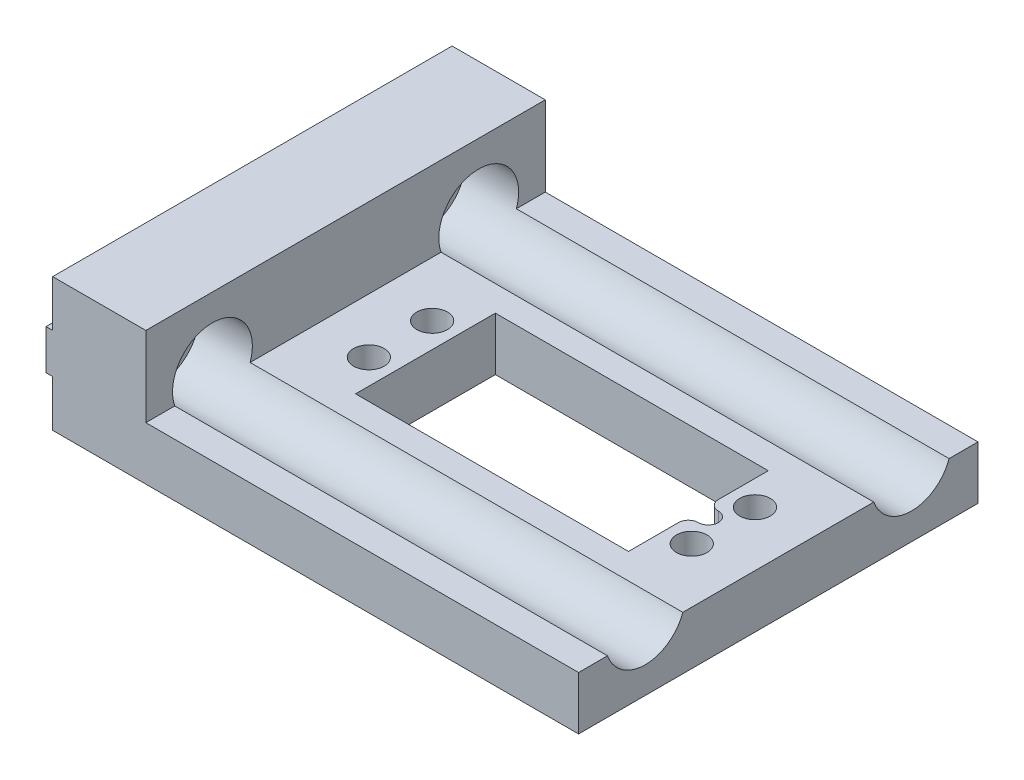
ISO-10303-21;
HEADER;
FILE_DESCRIPTION(('STEP AP214'),'2;1');
FILE_NAME('part.step','',(''),(''),'','','');
FILE_SCHEMA(('AUTOMOTIVE_DESIGN { 1 0 10303 214 1 1 1 1 }'));
ENDSEC;
DATA;
#1=APPLICATION_CONTEXT('core data for automotive mechanical design processes');
#2=APPLICATION_PROTOCOL_DEFINITION('international standard','automotive_design',2000,#1);
#3=PRODUCT_CONTEXT('',#1,'mechanical');
#4=PRODUCT('Part','Part','',(#3));
#5=PRODUCT_RELATED_PRODUCT_CATEGORY('part','',(#4));
#6=PRODUCT_DEFINITION_FORMATION('','',#4);
#7=PRODUCT_DEFINITION_CONTEXT('part definition',#1,'design');
#8=PRODUCT_DEFINITION('design','',#6,#7);
#9=PRODUCT_DEFINITION_SHAPE('','',#8);
#10=(LENGTH_UNIT() NAMED_UNIT(*) SI_UNIT(.MILLI.,.METRE.));
#11=(NAMED_UNIT(*) PLANE_ANGLE_UNIT() SI_UNIT($,.RADIAN.));
#12=(NAMED_UNIT(*) SI_UNIT($,.STERADIAN.) SOLID_ANGLE_UNIT());
#13=UNCERTAINTY_MEASURE_WITH_UNIT(LENGTH_MEASURE(1.E-05),#10,'distance_accuracy_value','');
#14=(GEOMETRIC_REPRESENTATION_CONTEXT(3) GLOBAL_UNCERTAINTY_ASSIGNED_CONTEXT((#13)) GLOBAL_UNIT_ASSIGNED_CONTEXT((#10,
#11,#12)) REPRESENTATION_CONTEXT('',''));
#15=CARTESIAN_POINT('',(0.,0.,0.));
#16=DIRECTION('',(0.,0.,1.));
#17=DIRECTION('',(1.,0.,0.));
#18=AXIS2_PLACEMENT_3D('',#15,#16,#17);
#19=CARTESIAN_POINT('',(67.,-20.,19.5));
#20=DIRECTION('',(1.,0.,0.));
#21=DIRECTION('',(0.,1.,0.));
#22=AXIS2_PLACEMENT_3D('',#19,#20,#21);
#23=PLANE('',#22);
#24=DIRECTION('',(0.,0.,-1.));
#25=VECTOR('',#24,1.);
#26=CARTESIAN_POINT('',(67.,-20.,19.5));
#27=LINE('',#26,#25);
#28=CARTESIAN_POINT('',(67.,-20.,27.));
#29=VERTEX_POINT('',#28);
#30=CARTESIAN_POINT('',(67.,-20.,19.5));
#31=VERTEX_POINT('',#30);
#32=EDGE_CURVE('E193',#29,#31,#27,.T.);
#33=ORIENTED_EDGE('',*,*,#32,.F.);
#34=DIRECTION('',(0.,1.,0.));
#35=VECTOR('',#34,1.);
#36=CARTESIAN_POINT('',(67.,-20.,27.));
#37=LINE('',#36,#35);
#38=CARTESIAN_POINT('',(67.,-12.,27.));
#39=VERTEX_POINT('',#38);
#40=EDGE_CURVE('E361',#29,#39,#37,.T.);
#41=ORIENTED_EDGE('',*,*,#40,.T.);
#42=DIRECTION('',(0.,0.,-1.));
#43=VECTOR('',#42,1.);
#44=CARTESIAN_POINT('',(67.,-12.,19.5));
#45=LINE('',#44,#43);
#46=CARTESIAN_POINT('',(67.,-12.,19.5));
#47=VERTEX_POINT('',#46);
#48=EDGE_CURVE('E211',#39,#47,#45,.T.);
#49=ORIENTED_EDGE('',*,*,#48,.T.);
#50=DIRECTION('',(0.,1.,0.));
#51=VECTOR('',#50,1.);
#52=CARTESIAN_POINT('',(67.,-20.,19.5));
#53=LINE('',#52,#51);
#54=EDGE_CURVE('E209',#31,#47,#53,.T.);
#55=ORIENTED_EDGE('',*,*,#54,.F.);
#56=EDGE_LOOP('',(#33,#41,#49,#55));
#57=FACE_BOUND('',#56,.T.);
#58=ADVANCED_FACE('F39',(#57),#23,.F.);
#59=CARTESIAN_POINT('',(79.,-12.,60.));
#60=DIRECTION('',(0.,-1.,0.));
#61=DIRECTION('',(1.,0.,0.));
#62=AXIS2_PLACEMENT_3D('',#59,#60,#61);
#63=PLANE('',#62);
#64=CARTESIAN_POINT('',(70.75,-12.,34.75));
#65=DIRECTION('',(0.,1.,0.));
#66=DIRECTION('',(-1.,0.,0.));
#67=AXIS2_PLACEMENT_3D('',#64,#65,#66);
#68=CIRCLE('',#67,2.29999999999999);
#69=CARTESIAN_POINT('',(68.45,-12.,34.75));
#70=VERTEX_POINT('',#69);
#71=EDGE_CURVE('E387',#70,#70,#68,.T.);
#72=ORIENTED_EDGE('',*,*,#71,.F.);
#73=EDGE_LOOP('',(#72));
#74=FACE_BOUND('',#73,.T.);
#75=CARTESIAN_POINT('',(70.75,-12.,25.25));
#76=DIRECTION('',(0.,1.,0.));
#77=DIRECTION('',(-1.,0.,0.));
#78=AXIS2_PLACEMENT_3D('',#75,#76,#77);
#79=CIRCLE('',#78,2.29999999999999);
#80=CARTESIAN_POINT('',(68.45,-12.,25.25));
#81=VERTEX_POINT('',#80);
#82=EDGE_CURVE('E409',#81,#81,#79,.T.);
#83=ORIENTED_EDGE('',*,*,#82,.F.);
#84=EDGE_LOOP('',(#83));
#85=FACE_BOUND('',#84,.T.);
#86=CARTESIAN_POINT('',(22.25,-12.,25.25));
#87=DIRECTION('',(0.,1.,0.));
#88=DIRECTION('',(-1.,0.,0.));
#89=AXIS2_PLACEMENT_3D('',#86,#87,#88);
#90=CIRCLE('',#89,2.3);
#91=CARTESIAN_POINT('',(19.95,-12.,25.25));
#92=VERTEX_POINT('',#91);
#93=EDGE_CURVE('E400',#92,#92,#90,.T.);
#94=ORIENTED_EDGE('',*,*,#93,.F.);
#95=EDGE_LOOP('',(#94));
#96=FACE_BOUND('',#95,.T.);
#97=CARTESIAN_POINT('',(22.25,-12.,34.75));
#98=DIRECTION('',(0.,1.,0.));
#99=DIRECTION('',(-1.,0.,0.));
#100=AXIS2_PLACEMENT_3D('',#97,#98,#99);
#101=CIRCLE('',#100,2.3);
#102=CARTESIAN_POINT('',(19.95,-12.,34.75));
#103=VERTEX_POINT('',#102);
#104=EDGE_CURVE('E398',#103,#103,#101,.T.);
#105=ORIENTED_EDGE('',*,*,#104,.F.);
#106=EDGE_LOOP('',(#105));
#107=FACE_BOUND('',#106,.T.);
#108=ORIENTED_EDGE('',*,*,#48,.F.);
#109=CARTESIAN_POINT('',(68.5,-12.,27.));
#110=DIRECTION('',(0.,-1.,0.));
#111=DIRECTION('',(1.,0.,0.));
#112=AXIS2_PLACEMENT_3D('',#109,#110,#111);
#113=CIRCLE('',#112,1.5);
#114=CARTESIAN_POINT('',(68.5,-12.,28.5));
#115=VERTEX_POINT('',#114);
#116=EDGE_CURVE('E365',#39,#115,#113,.F.);
#117=ORIENTED_EDGE('',*,*,#116,.T.);
#118=CARTESIAN_POINT('',(68.5,-12.,30.));
#119=DIRECTION('',(0.,-1.,0.));
#120=DIRECTION('',(1.,0.,0.));
#121=AXIS2_PLACEMENT_3D('',#118,#119,#120);
#122=CIRCLE('',#121,1.5);
#123=CARTESIAN_POINT('',(70.,-12.,30.));
#124=VERTEX_POINT('',#123);
#125=EDGE_CURVE('E48',#115,#124,#122,.T.);
#126=ORIENTED_EDGE('',*,*,#125,.T.);
#127=CARTESIAN_POINT('',(68.5,-12.,30.));
#128=DIRECTION('',(0.,-1.,0.));
#129=DIRECTION('',(1.,0.,0.));
#130=AXIS2_PLACEMENT_3D('',#127,#128,#129);
#131=CIRCLE('',#130,1.5);
#132=CARTESIAN_POINT('',(68.5,-12.,31.5));
#133=VERTEX_POINT('',#132);
#134=EDGE_CURVE('E372',#124,#133,#131,.T.);
#135=ORIENTED_EDGE('',*,*,#134,.T.);
#136=CARTESIAN_POINT('',(68.5,-12.,33.));
#137=DIRECTION('',(0.,-1.,0.));
#138=DIRECTION('',(1.,0.,0.));
#139=AXIS2_PLACEMENT_3D('',#136,#137,#138);
#140=CIRCLE('',#139,1.5);
#141=CARTESIAN_POINT('',(67.,-12.,33.));
#142=VERTEX_POINT('',#141);
#143=EDGE_CURVE('E363',#133,#142,#140,.F.);
#144=ORIENTED_EDGE('',*,*,#143,.T.);
#145=CARTESIAN_POINT('',(67.,-12.,40.5));
#146=VERTEX_POINT('',#145);
#147=EDGE_CURVE('E228',#146,#142,#45,.T.);
#148=ORIENTED_EDGE('',*,*,#147,.F.);
#149=DIRECTION('',(1.,0.,0.));
#150=VECTOR('',#149,1.);
#151=CARTESIAN_POINT('',(26.,-12.,40.5));
#152=LINE('',#151,#150);
#153=CARTESIAN_POINT('',(26.,-12.,40.5));
#154=VERTEX_POINT('',#153);
#155=EDGE_CURVE('E206',#154,#146,#152,.T.);
#156=ORIENTED_EDGE('',*,*,#155,.F.);
#157=DIRECTION('',(0.,0.,1.));
#158=VECTOR('',#157,1.);
#159=CARTESIAN_POINT('',(26.,-12.,19.5));
#160=LINE('',#159,#158);
#161=CARTESIAN_POINT('',(26.,-12.,19.5));
#162=VERTEX_POINT('',#161);
#163=EDGE_CURVE('E233',#162,#154,#160,.T.);
#164=ORIENTED_EDGE('',*,*,#163,.F.);
#165=DIRECTION('',(-1.,0.,0.));
#166=VECTOR('',#165,1.);
#167=CARTESIAN_POINT('',(26.,-12.,19.5));
#168=LINE('',#167,#166);
#169=EDGE_CURVE('E231',#47,#162,#168,.T.);
#170=ORIENTED_EDGE('',*,*,#169,.F.);
#171=EDGE_LOOP('',(#108,#117,#126,#135,#144,#148,#156,#164,#170));
#172=FACE_BOUND('',#171,.T.);
#173=DIRECTION('',(0.,0.,-1.));
#174=VECTOR('',#173,1.);
#175=CARTESIAN_POINT('',(14.,-12.,60.));
#176=LINE('',#175,#174);
#177=CARTESIAN_POINT('',(14.,-12.,44.3431457505076));
#178=VERTEX_POINT('',#177);
#179=CARTESIAN_POINT('',(14.,-12.,15.6568542494924));
#180=VERTEX_POINT('',#179);
#181=EDGE_CURVE('E325',#178,#180,#176,.T.);
#182=ORIENTED_EDGE('',*,*,#181,.F.);
#183=DIRECTION('',(1.,0.,0.));
#184=VECTOR('',#183,1.);
#185=CARTESIAN_POINT('',(6.00000000000001,-12.,44.3431457505076));
#186=LINE('',#185,#184);
#187=CARTESIAN_POINT('',(79.,-12.,44.3431457505076));
#188=VERTEX_POINT('',#187);
#189=EDGE_CURVE('E264',#178,#188,#186,.T.);
#190=ORIENTED_EDGE('',*,*,#189,.T.);
#191=DIRECTION('',(0.,0.,-1.));
#192=VECTOR('',#191,1.);
#193=CARTESIAN_POINT('',(79.,-12.,60.));
#194=LINE('',#193,#192);
#195=CARTESIAN_POINT('',(79.,-12.,15.6568542494924));
#196=VERTEX_POINT('',#195);
#197=EDGE_CURVE('E330',#188,#196,#194,.T.);
#198=ORIENTED_EDGE('',*,*,#197,.T.);
#199=DIRECTION('',(1.,0.,0.));
#200=VECTOR('',#199,1.);
#201=CARTESIAN_POINT('',(6.00000000000001,-12.,15.6568542494924));
#202=LINE('',#201,#200);
#203=EDGE_CURVE('E254',#196,#180,#202,.F.);
#204=ORIENTED_EDGE('',*,*,#203,.T.);
#205=EDGE_LOOP('',(#182,#190,#198,#204));
#206=FACE_BOUND('',#205,.T.);
#207=ADVANCED_FACE('F426',(#74,#85,#96,#107,#172,#206),#63,.F.);
#208=CARTESIAN_POINT('',(14.,-12.,4.34314575050762));
#209=VERTEX_POINT('',#208);
#210=CARTESIAN_POINT('',(14.,-12.,0.));
#211=VERTEX_POINT('',#210);
#212=EDGE_CURVE('E320',#209,#211,#176,.T.);
#213=ORIENTED_EDGE('',*,*,#212,.F.);
#214=DIRECTION('',(1.,0.,0.));
#215=VECTOR('',#214,1.);
#216=CARTESIAN_POINT('',(6.00000000000001,-12.,4.34314575050762));
#217=LINE('',#216,#215);
#218=CARTESIAN_POINT('',(79.,-12.,4.34314575050762));
#219=VERTEX_POINT('',#218);
#220=EDGE_CURVE('E257',#209,#219,#217,.T.);
#221=ORIENTED_EDGE('',*,*,#220,.T.);
#222=CARTESIAN_POINT('',(79.,-12.,0.));
#223=VERTEX_POINT('',#222);
#224=EDGE_CURVE('E324',#219,#223,#194,.T.);
#225=ORIENTED_EDGE('',*,*,#224,.T.);
#226=DIRECTION('',(-1.,0.,0.));
#227=VECTOR('',#226,1.);
#228=CARTESIAN_POINT('',(79.,-12.,0.));
#229=LINE('',#228,#227);
#230=EDGE_CURVE('E314',#223,#211,#229,.T.);
#231=ORIENTED_EDGE('',*,*,#230,.T.);
#232=EDGE_LOOP('',(#213,#221,#225,#231));
#233=FACE_BOUND('',#232,.T.);
#234=ADVANCED_FACE('F429',(#233),#63,.F.);
#235=CARTESIAN_POINT('',(-0.999999999999999,-10.,10.));
#236=DIRECTION('',(1.,0.,0.));
#237=DIRECTION('',(0.,0.,-1.));
#238=AXIS2_PLACEMENT_3D('',#235,#236,#237);
#239=CYLINDRICAL_SURFACE('',#238,2.75);
#240=CARTESIAN_POINT('',(-0.999999999999999,-10.,10.));
#241=DIRECTION('',(1.,0.,0.));
#242=DIRECTION('',(0.,0.,-1.));
#243=AXIS2_PLACEMENT_3D('',#240,#241,#242);
#244=CIRCLE('',#243,2.75);
#245=CARTESIAN_POINT('',(-0.999999999999999,-10.,7.25));
#246=VERTEX_POINT('',#245);
#247=EDGE_CURVE('E267',#246,#246,#244,.T.);
#248=ORIENTED_EDGE('',*,*,#247,.F.);
#249=EDGE_LOOP('',(#248));
#250=FACE_BOUND('',#249,.T.);
#251=CARTESIAN_POINT('',(6.00000000000001,-10.,10.));
#252=DIRECTION('',(1.,0.,0.));
#253=DIRECTION('',(0.,0.,-1.));
#254=AXIS2_PLACEMENT_3D('',#251,#252,#253);
#255=CIRCLE('',#254,2.75);
#256=CARTESIAN_POINT('',(6.00000000000001,-10.,7.25));
#257=VERTEX_POINT('',#256);
#258=EDGE_CURVE('E258',#257,#257,#255,.F.);
#259=ORIENTED_EDGE('',*,*,#258,.F.);
#260=EDGE_LOOP('',(#259));
#261=FACE_BOUND('',#260,.T.);
#262=ADVANCED_FACE('F677',(#250,#261),#239,.F.);
#263=CARTESIAN_POINT('',(-0.999999999999999,-10.,50.));
#264=DIRECTION('',(1.,0.,0.));
#265=DIRECTION('',(0.,0.,-1.));
#266=AXIS2_PLACEMENT_3D('',#263,#264,#265);
#267=CYLINDRICAL_SURFACE('',#266,2.75);
#268=CARTESIAN_POINT('',(-0.999999999999999,-10.,50.));
#269=DIRECTION('',(1.,0.,0.));
#270=DIRECTION('',(0.,0.,-1.));
#271=AXIS2_PLACEMENT_3D('',#268,#269,#270);
#272=CIRCLE('',#271,2.75);
#273=CARTESIAN_POINT('',(-0.999999999999999,-10.,47.25));
#274=VERTEX_POINT('',#273);
#275=EDGE_CURVE('E268',#274,#274,#272,.T.);
#276=ORIENTED_EDGE('',*,*,#275,.F.);
#277=EDGE_LOOP('',(#276));
#278=FACE_BOUND('',#277,.T.);
#279=CARTESIAN_POINT('',(6.00000000000001,-10.,50.));
#280=DIRECTION('',(1.,0.,0.));
#281=DIRECTION('',(0.,0.,-1.));
#282=AXIS2_PLACEMENT_3D('',#279,#280,#281);
#283=CIRCLE('',#282,2.75);
#284=CARTESIAN_POINT('',(6.00000000000001,-10.,47.25));
#285=VERTEX_POINT('',#284);
#286=EDGE_CURVE('E247',#285,#285,#283,.F.);
#287=ORIENTED_EDGE('',*,*,#286,.F.);
#288=EDGE_LOOP('',(#287));
#289=FACE_BOUND('',#288,.T.);
#290=ADVANCED_FACE('F562',(#278,#289),#267,.F.);
#291=CARTESIAN_POINT('',(14.,0.,60.));
#292=DIRECTION('',(0.,-1.,0.));
#293=DIRECTION('',(1.,0.,0.));
#294=AXIS2_PLACEMENT_3D('',#291,#292,#293);
#295=PLANE('',#294);
#296=DIRECTION('',(-1.,0.,0.));
#297=VECTOR('',#296,1.);
#298=CARTESIAN_POINT('',(14.,0.,0.));
#299=LINE('',#298,#297);
#300=CARTESIAN_POINT('',(14.,0.,0.));
#301=VERTEX_POINT('',#300);
#302=CARTESIAN_POINT('',(0.,0.,0.));
#303=VERTEX_POINT('',#302);
#304=EDGE_CURVE('E271',#301,#303,#299,.T.);
#305=ORIENTED_EDGE('',*,*,#304,.T.);
#306=DIRECTION('',(0.,0.,-1.));
#307=VECTOR('',#306,1.);
#308=CARTESIAN_POINT('',(0.,0.,60.));
#309=LINE('',#308,#307);
#310=CARTESIAN_POINT('',(0.,0.,60.));
#311=VERTEX_POINT('',#310);
#312=EDGE_CURVE('E348',#311,#303,#309,.T.);
#313=ORIENTED_EDGE('',*,*,#312,.F.);
#314=DIRECTION('',(-1.,0.,0.));
#315=VECTOR('',#314,1.);
#316=CARTESIAN_POINT('',(14.,0.,60.));
#317=LINE('',#316,#315);
#318=CARTESIAN_POINT('',(14.,0.,60.));
#319=VERTEX_POINT('',#318);
#320=EDGE_CURVE('E274',#319,#311,#317,.T.);
#321=ORIENTED_EDGE('',*,*,#320,.F.);
#322=DIRECTION('',(0.,0.,-1.));
#323=VECTOR('',#322,1.);
#324=CARTESIAN_POINT('',(14.,0.,60.));
#325=LINE('',#324,#323);
#326=EDGE_CURVE('E296',#319,#301,#325,.T.);
#327=ORIENTED_EDGE('',*,*,#326,.T.);
#328=EDGE_LOOP('',(#305,#313,#321,#327));
#329=FACE_BOUND('',#328,.T.);
#330=ADVANCED_FACE('F454',(#329),#295,.F.);
#331=CARTESIAN_POINT('',(0.,0.,60.));
#332=DIRECTION('',(1.,0.,0.));
#333=DIRECTION('',(0.,0.,-1.));
#334=AXIS2_PLACEMENT_3D('',#331,#332,#333);
#335=PLANE('',#334);
#336=DIRECTION('',(0.,-1.,0.));
#337=VECTOR('',#336,1.);
#338=CARTESIAN_POINT('',(0.,0.,0.));
#339=LINE('',#338,#337);
#340=CARTESIAN_POINT('',(0.,-7.,0.));
#341=VERTEX_POINT('',#340);
#342=EDGE_CURVE('E299',#303,#341,#339,.T.);
#343=ORIENTED_EDGE('',*,*,#342,.T.);
#344=DIRECTION('',(0.,0.,-1.));
#345=VECTOR('',#344,1.);
#346=CARTESIAN_POINT('',(0.,-7.,60.));
#347=LINE('',#346,#345);
#348=CARTESIAN_POINT('',(0.,-7.,60.));
#349=VERTEX_POINT('',#348);
#350=EDGE_CURVE('E345',#349,#341,#347,.T.);
#351=ORIENTED_EDGE('',*,*,#350,.F.);
#352=DIRECTION('',(0.,-1.,0.));
#353=VECTOR('',#352,1.);
#354=CARTESIAN_POINT('',(0.,0.,60.));
#355=LINE('',#354,#353);
#356=EDGE_CURVE('E277',#311,#349,#355,.T.);
#357=ORIENTED_EDGE('',*,*,#356,.F.);
#358=ORIENTED_EDGE('',*,*,#312,.T.);
#359=EDGE_LOOP('',(#343,#351,#357,#358));
#360=FACE_BOUND('',#359,.T.);
#361=ADVANCED_FACE('F555',(#360),#335,.F.);
#362=CARTESIAN_POINT('',(0.,-7.,60.));
#363=DIRECTION('',(0.,-1.,0.));
#364=DIRECTION('',(1.,0.,0.));
#365=AXIS2_PLACEMENT_3D('',#362,#363,#364);
#366=PLANE('',#365);
#367=DIRECTION('',(-1.,0.,0.));
#368=VECTOR('',#367,1.);
#369=CARTESIAN_POINT('',(0.,-7.,0.));
#370=LINE('',#369,#368);
#371=CARTESIAN_POINT('',(-1.,-7.,0.));
#372=VERTEX_POINT('',#371);
#373=EDGE_CURVE('E301',#341,#372,#370,.T.);
#374=ORIENTED_EDGE('',*,*,#373,.T.);
#375=DIRECTION('',(0.,0.,-1.));
#376=VECTOR('',#375,1.);
#377=CARTESIAN_POINT('',(-1.,-7.,60.));
#378=LINE('',#377,#376);
#379=CARTESIAN_POINT('',(-1.,-7.,60.));
#380=VERTEX_POINT('',#379);
#381=EDGE_CURVE('E342',#380,#372,#378,.T.);
#382=ORIENTED_EDGE('',*,*,#381,.F.);
#383=DIRECTION('',(-1.,0.,0.));
#384=VECTOR('',#383,1.);
#385=CARTESIAN_POINT('',(0.,-7.,60.));
#386=LINE('',#385,#384);
#387=EDGE_CURVE('E280',#349,#380,#386,.T.);
#388=ORIENTED_EDGE('',*,*,#387,.F.);
#389=ORIENTED_EDGE('',*,*,#350,.T.);
#390=EDGE_LOOP('',(#374,#382,#388,#389));
#391=FACE_BOUND('',#390,.T.);
#392=ADVANCED_FACE('F551',(#391),#366,.F.);
#393=CARTESIAN_POINT('',(-1.,-7.,60.));
#394=DIRECTION('',(1.,0.,0.));
#395=DIRECTION('',(0.,0.,-1.));
#396=AXIS2_PLACEMENT_3D('',#393,#394,#395);
#397=PLANE('',#396);
#398=ORIENTED_EDGE('',*,*,#275,.T.);
#399=EDGE_LOOP('',(#398));
#400=FACE_BOUND('',#399,.T.);
#401=ORIENTED_EDGE('',*,*,#247,.T.);
#402=EDGE_LOOP('',(#401));
#403=FACE_BOUND('',#402,.T.);
#404=DIRECTION('',(0.,-1.,0.));
#405=VECTOR('',#404,1.);
#406=CARTESIAN_POINT('',(-1.,-7.,0.));
#407=LINE('',#406,#405);
#408=CARTESIAN_POINT('',(-1.,-13.,0.));
#409=VERTEX_POINT('',#408);
#410=EDGE_CURVE('E303',#372,#409,#407,.T.);
#411=ORIENTED_EDGE('',*,*,#410,.T.);
#412=DIRECTION('',(0.,0.,-1.));
#413=VECTOR('',#412,1.);
#414=CARTESIAN_POINT('',(-1.,-13.,60.));
#415=LINE('',#414,#413);
#416=CARTESIAN_POINT('',(-1.,-13.,60.));
#417=VERTEX_POINT('',#416);
#418=EDGE_CURVE('E339',#417,#409,#415,.T.);
#419=ORIENTED_EDGE('',*,*,#418,.F.);
#420=DIRECTION('',(0.,-1.,0.));
#421=VECTOR('',#420,1.);
#422=CARTESIAN_POINT('',(-1.,-7.,60.));
#423=LINE('',#422,#421);
#424=EDGE_CURVE('E282',#380,#417,#423,.T.);
#425=ORIENTED_EDGE('',*,*,#424,.F.);
#426=ORIENTED_EDGE('',*,*,#381,.T.);
#427=EDGE_LOOP('',(#411,#419,#425,#426));
#428=FACE_BOUND('',#427,.T.);
#429=ADVANCED_FACE('F547',(#400,#403,#428),#397,.F.);
#430=CARTESIAN_POINT('',(-1.,-13.,60.));
#431=DIRECTION('',(0.,1.,0.));
#432=DIRECTION('',(-1.,0.,0.));
#433=AXIS2_PLACEMENT_3D('',#430,#431,#432);
#434=PLANE('',#433);
#435=DIRECTION('',(1.,0.,0.));
#436=VECTOR('',#435,1.);
#437=CARTESIAN_POINT('',(-1.,-13.,0.));
#438=LINE('',#437,#436);
#439=CARTESIAN_POINT('',(0.,-13.,0.));
#440=VERTEX_POINT('',#439);
#441=EDGE_CURVE('E305',#409,#440,#438,.T.);
#442=ORIENTED_EDGE('',*,*,#441,.T.);
#443=DIRECTION('',(0.,0.,-1.));
#444=VECTOR('',#443,1.);
#445=CARTESIAN_POINT('',(0.,-13.,60.));
#446=LINE('',#445,#444);
#447=CARTESIAN_POINT('',(0.,-13.,60.));
#448=VERTEX_POINT('',#447);
#449=EDGE_CURVE('E336',#448,#440,#446,.T.);
#450=ORIENTED_EDGE('',*,*,#449,.F.);
#451=DIRECTION('',(1.,0.,0.));
#452=VECTOR('',#451,1.);
#453=CARTESIAN_POINT('',(-1.,-13.,60.));
#454=LINE('',#453,#452);
#455=EDGE_CURVE('E284',#417,#448,#454,.T.);
#456=ORIENTED_EDGE('',*,*,#455,.F.);
#457=ORIENTED_EDGE('',*,*,#418,.T.);
#458=EDGE_LOOP('',(#442,#450,#456,#457));
#459=FACE_BOUND('',#458,.T.);
#460=ADVANCED_FACE('F541',(#459),#434,.F.);
#461=CARTESIAN_POINT('',(0.,-13.,60.));
#462=DIRECTION('',(1.,0.,0.));
#463=DIRECTION('',(0.,0.,-1.));
#464=AXIS2_PLACEMENT_3D('',#461,#462,#463);
#465=PLANE('',#464);
#466=DIRECTION('',(0.,-1.,0.));
#467=VECTOR('',#466,1.);
#468=CARTESIAN_POINT('',(0.,-13.,0.));
#469=LINE('',#468,#467);
#470=CARTESIAN_POINT('',(0.,-20.,0.));
#471=VERTEX_POINT('',#470);
#472=EDGE_CURVE('E307',#440,#471,#469,.T.);
#473=ORIENTED_EDGE('',*,*,#472,.T.);
#474=DIRECTION('',(0.,0.,-1.));
#475=VECTOR('',#474,1.);
#476=CARTESIAN_POINT('',(0.,-20.,60.));
#477=LINE('',#476,#475);
#478=CARTESIAN_POINT('',(0.,-20.,60.));
#479=VERTEX_POINT('',#478);
#480=EDGE_CURVE('E333',#479,#471,#477,.T.);
#481=ORIENTED_EDGE('',*,*,#480,.F.);
#482=DIRECTION('',(0.,-1.,0.));
#483=VECTOR('',#482,1.);
#484=CARTESIAN_POINT('',(0.,-13.,60.));
#485=LINE('',#484,#483);
#486=EDGE_CURVE('E286',#448,#479,#485,.T.);
#487=ORIENTED_EDGE('',*,*,#486,.F.);
#488=ORIENTED_EDGE('',*,*,#449,.T.);
#489=EDGE_LOOP('',(#473,#481,#487,#488));
#490=FACE_BOUND('',#489,.T.);
#491=ADVANCED_FACE('F533',(#490),#465,.F.);
#492=CARTESIAN_POINT('',(0.,-20.,60.));
#493=DIRECTION('',(0.,1.,0.));
#494=DIRECTION('',(0.,0.,1.));
#495=AXIS2_PLACEMENT_3D('',#492,#493,#494);
#496=PLANE('',#495);
#497=CARTESIAN_POINT('',(70.75,-20.,34.75));
#498=DIRECTION('',(0.,1.,0.));
#499=DIRECTION('',(-1.,0.,0.));
#500=AXIS2_PLACEMENT_3D('',#497,#498,#499);
#501=CIRCLE('',#500,2.29999999999999);
#502=CARTESIAN_POINT('',(68.45,-20.,34.75));
#503=VERTEX_POINT('',#502);
#504=EDGE_CURVE('E383',#503,#503,#501,.T.);
#505=ORIENTED_EDGE('',*,*,#504,.T.);
#506=EDGE_LOOP('',(#505));
#507=FACE_BOUND('',#506,.T.);
#508=CARTESIAN_POINT('',(70.75,-20.,25.25));
#509=DIRECTION('',(0.,1.,0.));
#510=DIRECTION('',(-1.,0.,0.));
#511=AXIS2_PLACEMENT_3D('',#508,#509,#510);
#512=CIRCLE('',#511,2.29999999999999);
#513=CARTESIAN_POINT('',(68.45,-20.,25.25));
#514=VERTEX_POINT('',#513);
#515=EDGE_CURVE('E392',#514,#514,#512,.T.);
#516=ORIENTED_EDGE('',*,*,#515,.T.);
#517=EDGE_LOOP('',(#516));
#518=FACE_BOUND('',#517,.T.);
#519=CARTESIAN_POINT('',(22.25,-20.,25.25));
#520=DIRECTION('',(0.,1.,0.));
#521=DIRECTION('',(-1.,0.,0.));
#522=AXIS2_PLACEMENT_3D('',#519,#520,#521);
#523=CIRCLE('',#522,2.3);
#524=CARTESIAN_POINT('',(19.95,-20.,25.25));
#525=VERTEX_POINT('',#524);
#526=EDGE_CURVE('E404',#525,#525,#523,.T.);
#527=ORIENTED_EDGE('',*,*,#526,.T.);
#528=EDGE_LOOP('',(#527));
#529=FACE_BOUND('',#528,.T.);
#530=CARTESIAN_POINT('',(22.25,-20.,34.75));
#531=DIRECTION('',(0.,1.,0.));
#532=DIRECTION('',(-1.,0.,0.));
#533=AXIS2_PLACEMENT_3D('',#530,#531,#532);
#534=CIRCLE('',#533,2.3);
#535=CARTESIAN_POINT('',(19.95,-20.,34.75));
#536=VERTEX_POINT('',#535);
#537=EDGE_CURVE('E396',#536,#536,#534,.T.);
#538=ORIENTED_EDGE('',*,*,#537,.T.);
#539=EDGE_LOOP('',(#538));
#540=FACE_BOUND('',#539,.T.);
#541=CARTESIAN_POINT('',(68.5,-20.,30.));
#542=DIRECTION('',(0.,1.,0.));
#543=DIRECTION('',(0.,0.,1.));
#544=AXIS2_PLACEMENT_3D('',#541,#542,#543);
#545=CIRCLE('',#544,1.5);
#546=CARTESIAN_POINT('',(68.5,-20.,31.5));
#547=VERTEX_POINT('',#546);
#548=CARTESIAN_POINT('',(70.,-20.,30.));
#549=VERTEX_POINT('',#548);
#550=EDGE_CURVE('E55',#547,#549,#545,.T.);
#551=ORIENTED_EDGE('',*,*,#550,.T.);
#552=CARTESIAN_POINT('',(68.5,-20.,30.));
#553=DIRECTION('',(0.,1.,0.));
#554=DIRECTION('',(0.,0.,1.));
#555=AXIS2_PLACEMENT_3D('',#552,#553,#554);
#556=CIRCLE('',#555,1.5);
#557=CARTESIAN_POINT('',(68.5,-20.,28.5));
#558=VERTEX_POINT('',#557);
#559=EDGE_CURVE('E11',#549,#558,#556,.T.);
#560=ORIENTED_EDGE('',*,*,#559,.T.);
#561=CARTESIAN_POINT('',(68.5,-20.,27.));
#562=DIRECTION('',(0.,1.,0.));
#563=DIRECTION('',(0.,0.,1.));
#564=AXIS2_PLACEMENT_3D('',#561,#562,#563);
#565=CIRCLE('',#564,1.5);
#566=EDGE_CURVE('E201',#558,#29,#565,.F.);
#567=ORIENTED_EDGE('',*,*,#566,.T.);
#568=ORIENTED_EDGE('',*,*,#32,.T.);
#569=DIRECTION('',(-1.,0.,0.));
#570=VECTOR('',#569,1.);
#571=CARTESIAN_POINT('',(26.,-20.,19.5));
#572=LINE('',#571,#570);
#573=CARTESIAN_POINT('',(26.,-20.,19.5));
#574=VERTEX_POINT('',#573);
#575=EDGE_CURVE('E199',#31,#574,#572,.T.);
#576=ORIENTED_EDGE('',*,*,#575,.T.);
#577=DIRECTION('',(0.,0.,1.));
#578=VECTOR('',#577,1.);
#579=CARTESIAN_POINT('',(26.,-20.,19.5));
#580=LINE('',#579,#578);
#581=CARTESIAN_POINT('',(26.,-20.,40.5));
#582=VERTEX_POINT('',#581);
#583=EDGE_CURVE('E220',#574,#582,#580,.T.);
#584=ORIENTED_EDGE('',*,*,#583,.T.);
#585=DIRECTION('',(1.,0.,0.));
#586=VECTOR('',#585,1.);
#587=CARTESIAN_POINT('',(26.,-20.,40.5));
#588=LINE('',#587,#586);
#589=CARTESIAN_POINT('',(67.,-20.,40.5));
#590=VERTEX_POINT('',#589);
#591=EDGE_CURVE('E216',#582,#590,#588,.T.);
#592=ORIENTED_EDGE('',*,*,#591,.T.);
#593=CARTESIAN_POINT('',(67.,-20.,33.));
#594=VERTEX_POINT('',#593);
#595=EDGE_CURVE('E205',#590,#594,#27,.T.);
#596=ORIENTED_EDGE('',*,*,#595,.T.);
#597=CARTESIAN_POINT('',(68.5,-20.,33.));
#598=DIRECTION('',(0.,1.,0.));
#599=DIRECTION('',(0.,0.,1.));
#600=AXIS2_PLACEMENT_3D('',#597,#598,#599);
#601=CIRCLE('',#600,1.5);
#602=EDGE_CURVE('E367',#594,#547,#601,.F.);
#603=ORIENTED_EDGE('',*,*,#602,.T.);
#604=EDGE_LOOP('',(#551,#560,#567,#568,#576,#584,#592,#596,#603));
#605=FACE_BOUND('',#604,.T.);
#606=DIRECTION('',(1.,0.,0.));
#607=VECTOR('',#606,1.);
#608=CARTESIAN_POINT('',(0.,-20.,0.));
#609=LINE('',#608,#607);
#610=CARTESIAN_POINT('',(79.,-20.,0.));
#611=VERTEX_POINT('',#610);
#612=EDGE_CURVE('E309',#471,#611,#609,.T.);
#613=ORIENTED_EDGE('',*,*,#612,.T.);
#614=DIRECTION('',(0.,0.,-1.));
#615=VECTOR('',#614,1.);
#616=CARTESIAN_POINT('',(79.,-20.,60.));
#617=LINE('',#616,#615);
#618=CARTESIAN_POINT('',(79.,-20.,60.));
#619=VERTEX_POINT('',#618);
#620=EDGE_CURVE('E329',#619,#611,#617,.T.);
#621=ORIENTED_EDGE('',*,*,#620,.F.);
#622=DIRECTION('',(1.,0.,0.));
#623=VECTOR('',#622,1.);
#624=CARTESIAN_POINT('',(0.,-20.,60.));
#625=LINE('',#624,#623);
#626=EDGE_CURVE('E288',#479,#619,#625,.T.);
#627=ORIENTED_EDGE('',*,*,#626,.F.);
#628=ORIENTED_EDGE('',*,*,#480,.T.);
#629=EDGE_LOOP('',(#613,#621,#627,#628));
#630=FACE_BOUND('',#629,.T.);
#631=ADVANCED_FACE('F195',(#507,#518,#529,#540,#605,#630),#496,.F.);
#632=CARTESIAN_POINT('',(79.,-20.,60.));
#633=DIRECTION('',(-1.,0.,0.));
#634=DIRECTION('',(0.,0.,1.));
#635=AXIS2_PLACEMENT_3D('',#632,#633,#634);
#636=PLANE('',#635);
#637=ORIENTED_EDGE('',*,*,#197,.F.);
#638=CARTESIAN_POINT('',(79.,-10.,50.));
#639=DIRECTION('',(1.,0.,0.));
#640=DIRECTION('',(0.,0.,-1.));
#641=AXIS2_PLACEMENT_3D('',#638,#639,#640);
#642=CIRCLE('',#641,5.99999999999999);
#643=CARTESIAN_POINT('',(79.,-12.,55.6568542494924));
#644=VERTEX_POINT('',#643);
#645=EDGE_CURVE('E248',#644,#188,#642,.T.);
#646=ORIENTED_EDGE('',*,*,#645,.F.);
#647=CARTESIAN_POINT('',(79.,-12.,60.));
#648=VERTEX_POINT('',#647);
#649=EDGE_CURVE('E326',#648,#644,#194,.T.);
#650=ORIENTED_EDGE('',*,*,#649,.F.);
#651=DIRECTION('',(0.,1.,0.));
#652=VECTOR('',#651,1.);
#653=CARTESIAN_POINT('',(79.,-20.,60.));
#654=LINE('',#653,#652);
#655=EDGE_CURVE('E290',#619,#648,#654,.T.);
#656=ORIENTED_EDGE('',*,*,#655,.F.);
#657=ORIENTED_EDGE('',*,*,#620,.T.);
#658=DIRECTION('',(0.,1.,0.));
#659=VECTOR('',#658,1.);
#660=CARTESIAN_POINT('',(79.,-20.,0.));
#661=LINE('',#660,#659);
#662=EDGE_CURVE('E311',#611,#223,#661,.T.);
#663=ORIENTED_EDGE('',*,*,#662,.T.);
#664=ORIENTED_EDGE('',*,*,#224,.F.);
#665=CARTESIAN_POINT('',(79.,-10.,10.));
#666=DIRECTION('',(1.,0.,0.));
#667=DIRECTION('',(0.,0.,-1.));
#668=AXIS2_PLACEMENT_3D('',#665,#666,#667);
#669=CIRCLE('',#668,6.);
#670=EDGE_CURVE('E250',#196,#219,#669,.T.);
#671=ORIENTED_EDGE('',*,*,#670,.F.);
#672=EDGE_LOOP('',(#637,#646,#650,#656,#657,#663,#664,#671));
#673=FACE_BOUND('',#672,.T.);
#674=ADVANCED_FACE('F468',(#673),#636,.F.);
#675=ORIENTED_EDGE('',*,*,#649,.T.);
#676=DIRECTION('',(1.,0.,0.));
#677=VECTOR('',#676,1.);
#678=CARTESIAN_POINT('',(6.00000000000001,-12.,55.6568542494924));
#679=LINE('',#678,#677);
#680=CARTESIAN_POINT('',(14.,-12.,55.6568542494924));
#681=VERTEX_POINT('',#680);
#682=EDGE_CURVE('E261',#644,#681,#679,.F.);
#683=ORIENTED_EDGE('',*,*,#682,.T.);
#684=CARTESIAN_POINT('',(14.,-12.,60.));
#685=VERTEX_POINT('',#684);
#686=EDGE_CURVE('E321',#685,#681,#176,.T.);
#687=ORIENTED_EDGE('',*,*,#686,.F.);
#688=DIRECTION('',(-1.,0.,0.));
#689=VECTOR('',#688,1.);
#690=CARTESIAN_POINT('',(79.,-12.,60.));
#691=LINE('',#690,#689);
#692=EDGE_CURVE('E292',#648,#685,#691,.T.);
#693=ORIENTED_EDGE('',*,*,#692,.F.);
#694=EDGE_LOOP('',(#675,#683,#687,#693));
#695=FACE_BOUND('',#694,.T.);
#696=ADVANCED_FACE('F432',(#695),#63,.F.);
#697=CARTESIAN_POINT('',(14.,-12.,60.));
#698=DIRECTION('',(-1.,0.,0.));
#699=DIRECTION('',(0.,0.,1.));
#700=AXIS2_PLACEMENT_3D('',#697,#698,#699);
#701=PLANE('',#700);
#702=ORIENTED_EDGE('',*,*,#686,.T.);
#703=CARTESIAN_POINT('',(14.,-10.,50.));
#704=DIRECTION('',(-1.,0.,0.));
#705=DIRECTION('',(0.,0.,1.));
#706=AXIS2_PLACEMENT_3D('',#703,#704,#705);
#707=CIRCLE('',#706,5.99999999999999);
#708=EDGE_CURVE('E358',#681,#178,#707,.T.);
#709=ORIENTED_EDGE('',*,*,#708,.T.);
#710=ORIENTED_EDGE('',*,*,#181,.T.);
#711=CARTESIAN_POINT('',(14.,-10.,10.));
#712=DIRECTION('',(-1.,0.,0.));
#713=DIRECTION('',(0.,0.,1.));
#714=AXIS2_PLACEMENT_3D('',#711,#712,#713);
#715=CIRCLE('',#714,6.);
#716=EDGE_CURVE('E351',#180,#209,#715,.T.);
#717=ORIENTED_EDGE('',*,*,#716,.T.);
#718=ORIENTED_EDGE('',*,*,#212,.T.);
#719=DIRECTION('',(0.,1.,0.));
#720=VECTOR('',#719,1.);
#721=CARTESIAN_POINT('',(14.,-12.,0.));
#722=LINE('',#721,#720);
#723=EDGE_CURVE('E278',#211,#301,#722,.T.);
#724=ORIENTED_EDGE('',*,*,#723,.T.);
#725=ORIENTED_EDGE('',*,*,#326,.F.);
#726=DIRECTION('',(0.,1.,0.));
#727=VECTOR('',#726,1.);
#728=CARTESIAN_POINT('',(14.,-12.,60.));
#729=LINE('',#728,#727);
#730=EDGE_CURVE('E294',#685,#319,#729,.T.);
#731=ORIENTED_EDGE('',*,*,#730,.F.);
#732=EDGE_LOOP('',(#702,#709,#710,#717,#718,#724,#725,#731));
#733=FACE_BOUND('',#732,.T.);
#734=ADVANCED_FACE('F441',(#733),#701,.F.);
#735=CARTESIAN_POINT('',(0.,0.,60.));
#736=DIRECTION('',(0.,0.,1.));
#737=DIRECTION('',(1.,0.,0.));
#738=AXIS2_PLACEMENT_3D('',#735,#736,#737);
#739=PLANE('',#738);
#740=ORIENTED_EDGE('',*,*,#320,.T.);
#741=ORIENTED_EDGE('',*,*,#356,.T.);
#742=ORIENTED_EDGE('',*,*,#387,.T.);
#743=ORIENTED_EDGE('',*,*,#424,.T.);
#744=ORIENTED_EDGE('',*,*,#455,.T.);
#745=ORIENTED_EDGE('',*,*,#486,.T.);
#746=ORIENTED_EDGE('',*,*,#626,.T.);
#747=ORIENTED_EDGE('',*,*,#655,.T.);
#748=ORIENTED_EDGE('',*,*,#692,.T.);
#749=ORIENTED_EDGE('',*,*,#730,.T.);
#750=EDGE_LOOP('',(#740,#741,#742,#743,#744,#745,#746,#747,#748,#749));
#751=FACE_BOUND('',#750,.T.);
#752=ADVANCED_FACE('F459',(#751),#739,.T.);
#753=CARTESIAN_POINT('',(0.,0.,0.));
#754=DIRECTION('',(0.,0.,1.));
#755=DIRECTION('',(1.,0.,0.));
#756=AXIS2_PLACEMENT_3D('',#753,#754,#755);
#757=PLANE('',#756);
#758=ORIENTED_EDGE('',*,*,#304,.F.);
#759=ORIENTED_EDGE('',*,*,#723,.F.);
#760=ORIENTED_EDGE('',*,*,#230,.F.);
#761=ORIENTED_EDGE('',*,*,#662,.F.);
#762=ORIENTED_EDGE('',*,*,#612,.F.);
#763=ORIENTED_EDGE('',*,*,#472,.F.);
#764=ORIENTED_EDGE('',*,*,#441,.F.);
#765=ORIENTED_EDGE('',*,*,#410,.F.);
#766=ORIENTED_EDGE('',*,*,#373,.F.);
#767=ORIENTED_EDGE('',*,*,#342,.F.);
#768=EDGE_LOOP('',(#758,#759,#760,#761,#762,#763,#764,#765,#766,#767));
#769=FACE_BOUND('',#768,.T.);
#770=ADVANCED_FACE('F450',(#769),#757,.F.);
#771=CARTESIAN_POINT('',(6.00000000000001,-10.,50.));
#772=DIRECTION('',(1.,0.,0.));
#773=DIRECTION('',(0.,0.,-1.));
#774=AXIS2_PLACEMENT_3D('',#771,#772,#773);
#775=CYLINDRICAL_SURFACE('',#774,5.99999999999999);
#776=CARTESIAN_POINT('',(6.00000000000001,-10.,50.));
#777=DIRECTION('',(1.,0.,0.));
#778=DIRECTION('',(0.,0.,-1.));
#779=AXIS2_PLACEMENT_3D('',#776,#777,#778);
#780=CIRCLE('',#779,5.99999999999999);
#781=CARTESIAN_POINT('',(6.00000000000001,-10.,44.));
#782=VERTEX_POINT('',#781);
#783=EDGE_CURVE('E244',#782,#782,#780,.T.);
#784=ORIENTED_EDGE('',*,*,#783,.F.);
#785=EDGE_LOOP('',(#784));
#786=FACE_BOUND('',#785,.T.);
#787=ORIENTED_EDGE('',*,*,#708,.F.);
#788=ORIENTED_EDGE('',*,*,#682,.F.);
#789=ORIENTED_EDGE('',*,*,#645,.T.);
#790=ORIENTED_EDGE('',*,*,#189,.F.);
#791=EDGE_LOOP('',(#787,#788,#789,#790));
#792=FACE_BOUND('',#791,.T.);
#793=ADVANCED_FACE('F466',(#786,#792),#775,.F.);
#794=CARTESIAN_POINT('',(6.00000000000001,-10.,50.));
#795=DIRECTION('',(1.,0.,0.));
#796=DIRECTION('',(0.,0.,-1.));
#797=AXIS2_PLACEMENT_3D('',#794,#795,#796);
#798=PLANE('',#797);
#799=ORIENTED_EDGE('',*,*,#783,.T.);
#800=EDGE_LOOP('',(#799));
#801=FACE_BOUND('',#800,.T.);
#802=ORIENTED_EDGE('',*,*,#286,.T.);
#803=EDGE_LOOP('',(#802));
#804=FACE_BOUND('',#803,.T.);
#805=ADVANCED_FACE('F474',(#801,#804),#798,.T.);
#806=CARTESIAN_POINT('',(6.00000000000001,-10.,10.));
#807=DIRECTION('',(1.,0.,0.));
#808=DIRECTION('',(0.,0.,-1.));
#809=AXIS2_PLACEMENT_3D('',#806,#807,#808);
#810=CYLINDRICAL_SURFACE('',#809,6.);
#811=CARTESIAN_POINT('',(6.00000000000001,-10.,10.));
#812=DIRECTION('',(1.,0.,0.));
#813=DIRECTION('',(0.,0.,-1.));
#814=AXIS2_PLACEMENT_3D('',#811,#812,#813);
#815=CIRCLE('',#814,6.);
#816=CARTESIAN_POINT('',(6.00000000000001,-10.,4.));
#817=VERTEX_POINT('',#816);
#818=EDGE_CURVE('E240',#817,#817,#815,.T.);
#819=ORIENTED_EDGE('',*,*,#818,.F.);
#820=EDGE_LOOP('',(#819));
#821=FACE_BOUND('',#820,.T.);
#822=ORIENTED_EDGE('',*,*,#716,.F.);
#823=ORIENTED_EDGE('',*,*,#203,.F.);
#824=ORIENTED_EDGE('',*,*,#670,.T.);
#825=ORIENTED_EDGE('',*,*,#220,.F.);
#826=EDGE_LOOP('',(#822,#823,#824,#825));
#827=FACE_BOUND('',#826,.T.);
#828=ADVANCED_FACE('F471',(#821,#827),#810,.F.);
#829=CARTESIAN_POINT('',(6.00000000000001,-10.,10.));
#830=DIRECTION('',(1.,0.,0.));
#831=DIRECTION('',(0.,0.,-1.));
#832=AXIS2_PLACEMENT_3D('',#829,#830,#831);
#833=PLANE('',#832);
#834=ORIENTED_EDGE('',*,*,#818,.T.);
#835=EDGE_LOOP('',(#834));
#836=FACE_BOUND('',#835,.T.);
#837=ORIENTED_EDGE('',*,*,#258,.T.);
#838=EDGE_LOOP('',(#837));
#839=FACE_BOUND('',#838,.T.);
#840=ADVANCED_FACE('F473',(#836,#839),#833,.T.);
#841=ORIENTED_EDGE('',*,*,#147,.T.);
#842=DIRECTION('',(0.,1.,0.));
#843=VECTOR('',#842,1.);
#844=CARTESIAN_POINT('',(67.,-20.,33.));
#845=LINE('',#844,#843);
#846=EDGE_CURVE('E370',#142,#594,#845,.F.);
#847=ORIENTED_EDGE('',*,*,#846,.T.);
#848=ORIENTED_EDGE('',*,*,#595,.F.);
#849=DIRECTION('',(0.,1.,0.));
#850=VECTOR('',#849,1.);
#851=CARTESIAN_POINT('',(67.,-20.,40.5));
#852=LINE('',#851,#850);
#853=EDGE_CURVE('E238',#590,#146,#852,.T.);
#854=ORIENTED_EDGE('',*,*,#853,.T.);
#855=EDGE_LOOP('',(#841,#847,#848,#854));
#856=FACE_BOUND('',#855,.T.);
#857=ADVANCED_FACE('F481',(#856),#23,.F.);
#858=CARTESIAN_POINT('',(26.,-20.,40.5));
#859=DIRECTION('',(0.,0.,1.));
#860=DIRECTION('',(1.,0.,0.));
#861=AXIS2_PLACEMENT_3D('',#858,#859,#860);
#862=PLANE('',#861);
#863=ORIENTED_EDGE('',*,*,#155,.T.);
#864=ORIENTED_EDGE('',*,*,#853,.F.);
#865=ORIENTED_EDGE('',*,*,#591,.F.);
#866=DIRECTION('',(0.,1.,0.));
#867=VECTOR('',#866,1.);
#868=CARTESIAN_POINT('',(26.,-20.,40.5));
#869=LINE('',#868,#867);
#870=EDGE_CURVE('E241',#582,#154,#869,.T.);
#871=ORIENTED_EDGE('',*,*,#870,.T.);
#872=EDGE_LOOP('',(#863,#864,#865,#871));
#873=FACE_BOUND('',#872,.T.);
#874=ADVANCED_FACE('F495',(#873),#862,.F.);
#875=CARTESIAN_POINT('',(26.,-20.,19.5));
#876=DIRECTION('',(-1.,0.,0.));
#877=DIRECTION('',(0.,0.,1.));
#878=AXIS2_PLACEMENT_3D('',#875,#876,#877);
#879=PLANE('',#878);
#880=ORIENTED_EDGE('',*,*,#163,.T.);
#881=ORIENTED_EDGE('',*,*,#870,.F.);
#882=ORIENTED_EDGE('',*,*,#583,.F.);
#883=DIRECTION('',(0.,1.,0.));
#884=VECTOR('',#883,1.);
#885=CARTESIAN_POINT('',(26.,-20.,19.5));
#886=LINE('',#885,#884);
#887=EDGE_CURVE('E215',#574,#162,#886,.T.);
#888=ORIENTED_EDGE('',*,*,#887,.T.);
#889=EDGE_LOOP('',(#880,#881,#882,#888));
#890=FACE_BOUND('',#889,.T.);
#891=ADVANCED_FACE('F502',(#890),#879,.F.);
#892=CARTESIAN_POINT('',(26.,-20.,19.5));
#893=DIRECTION('',(0.,0.,-1.));
#894=DIRECTION('',(-1.,0.,0.));
#895=AXIS2_PLACEMENT_3D('',#892,#893,#894);
#896=PLANE('',#895);
#897=ORIENTED_EDGE('',*,*,#169,.T.);
#898=ORIENTED_EDGE('',*,*,#887,.F.);
#899=ORIENTED_EDGE('',*,*,#575,.F.);
#900=ORIENTED_EDGE('',*,*,#54,.T.);
#901=EDGE_LOOP('',(#897,#898,#899,#900));
#902=FACE_BOUND('',#901,.T.);
#903=ADVANCED_FACE('F219',(#902),#896,.F.);
#904=CARTESIAN_POINT('',(22.25,-20.,34.75));
#905=DIRECTION('',(0.,1.,0.));
#906=DIRECTION('',(-1.,0.,0.));
#907=AXIS2_PLACEMENT_3D('',#904,#905,#906);
#908=CYLINDRICAL_SURFACE('',#907,2.3);
#909=ORIENTED_EDGE('',*,*,#537,.F.);
#910=EDGE_LOOP('',(#909));
#911=FACE_BOUND('',#910,.T.);
#912=ORIENTED_EDGE('',*,*,#104,.T.);
#913=EDGE_LOOP('',(#912));
#914=FACE_BOUND('',#913,.T.);
#915=ADVANCED_FACE('F520',(#911,#914),#908,.F.);
#916=CARTESIAN_POINT('',(22.25,-20.,25.25));
#917=DIRECTION('',(0.,1.,0.));
#918=DIRECTION('',(-1.,0.,0.));
#919=AXIS2_PLACEMENT_3D('',#916,#917,#918);
#920=CYLINDRICAL_SURFACE('',#919,2.3);
#921=ORIENTED_EDGE('',*,*,#526,.F.);
#922=EDGE_LOOP('',(#921));
#923=FACE_BOUND('',#922,.T.);
#924=ORIENTED_EDGE('',*,*,#93,.T.);
#925=EDGE_LOOP('',(#924));
#926=FACE_BOUND('',#925,.T.);
#927=ADVANCED_FACE('F422',(#923,#926),#920,.F.);
#928=CARTESIAN_POINT('',(70.75,-20.,25.25));
#929=DIRECTION('',(0.,1.,0.));
#930=DIRECTION('',(-1.,0.,0.));
#931=AXIS2_PLACEMENT_3D('',#928,#929,#930);
#932=CYLINDRICAL_SURFACE('',#931,2.29999999999999);
#933=ORIENTED_EDGE('',*,*,#515,.F.);
#934=EDGE_LOOP('',(#933));
#935=FACE_BOUND('',#934,.T.);
#936=ORIENTED_EDGE('',*,*,#82,.T.);
#937=EDGE_LOOP('',(#936));
#938=FACE_BOUND('',#937,.T.);
#939=ADVANCED_FACE('F418',(#935,#938),#932,.F.);
#940=CARTESIAN_POINT('',(70.75,-20.,34.75));
#941=DIRECTION('',(0.,1.,0.));
#942=DIRECTION('',(-1.,0.,0.));
#943=AXIS2_PLACEMENT_3D('',#940,#941,#942);
#944=CYLINDRICAL_SURFACE('',#943,2.29999999999999);
#945=ORIENTED_EDGE('',*,*,#504,.F.);
#946=EDGE_LOOP('',(#945));
#947=FACE_BOUND('',#946,.T.);
#948=ORIENTED_EDGE('',*,*,#71,.T.);
#949=EDGE_LOOP('',(#948));
#950=FACE_BOUND('',#949,.T.);
#951=ADVANCED_FACE('F421',(#947,#950),#944,.F.);
#952=CARTESIAN_POINT('',(68.5,-20.,33.));
#953=DIRECTION('',(0.,1.,0.));
#954=DIRECTION('',(-1.,0.,0.));
#955=AXIS2_PLACEMENT_3D('',#952,#953,#954);
#956=CYLINDRICAL_SURFACE('',#955,1.5);
#957=ORIENTED_EDGE('',*,*,#846,.F.);
#958=ORIENTED_EDGE('',*,*,#143,.F.);
#959=DIRECTION('',(0.,1.,0.));
#960=VECTOR('',#959,1.);
#961=CARTESIAN_POINT('',(68.5,-20.,31.5));
#962=LINE('',#961,#960);
#963=EDGE_CURVE('E43',#547,#133,#962,.T.);
#964=ORIENTED_EDGE('',*,*,#963,.F.);
#965=ORIENTED_EDGE('',*,*,#602,.F.);
#966=EDGE_LOOP('',(#957,#958,#964,#965));
#967=FACE_BOUND('',#966,.T.);
#968=ADVANCED_FACE('F41',(#967),#956,.T.);
#969=CARTESIAN_POINT('',(68.5,-20.,30.));
#970=DIRECTION('',(0.,-1.,0.));
#971=DIRECTION('',(1.,0.,0.));
#972=AXIS2_PLACEMENT_3D('',#969,#970,#971);
#973=CYLINDRICAL_SURFACE('',#972,1.5);
#974=ORIENTED_EDGE('',*,*,#963,.T.);
#975=ORIENTED_EDGE('',*,*,#134,.F.);
#976=DIRECTION('',(0.,1.,0.));
#977=VECTOR('',#976,1.);
#978=CARTESIAN_POINT('',(70.,-12.,30.));
#979=LINE('',#978,#977);
#980=EDGE_CURVE('E378',#549,#124,#979,.T.);
#981=ORIENTED_EDGE('',*,*,#980,.F.);
#982=ORIENTED_EDGE('',*,*,#550,.F.);
#983=EDGE_LOOP('',(#974,#975,#981,#982));
#984=FACE_BOUND('',#983,.T.);
#985=ADVANCED_FACE('F569',(#984),#973,.F.);
#986=CARTESIAN_POINT('',(68.5,-20.,30.));
#987=DIRECTION('',(0.,-1.,0.));
#988=DIRECTION('',(1.,0.,0.));
#989=AXIS2_PLACEMENT_3D('',#986,#987,#988);
#990=CYLINDRICAL_SURFACE('',#989,1.5);
#991=DIRECTION('',(0.,1.,0.));
#992=VECTOR('',#991,1.);
#993=CARTESIAN_POINT('',(68.5,-12.,28.5));
#994=LINE('',#993,#992);
#995=EDGE_CURVE('E376',#558,#115,#994,.T.);
#996=ORIENTED_EDGE('',*,*,#995,.F.);
#997=ORIENTED_EDGE('',*,*,#559,.F.);
#998=ORIENTED_EDGE('',*,*,#980,.T.);
#999=ORIENTED_EDGE('',*,*,#125,.F.);
#1000=EDGE_LOOP('',(#996,#997,#998,#999));
#1001=FACE_BOUND('',#1000,.T.);
#1002=ADVANCED_FACE('F566',(#1001),#990,.F.);
#1003=CARTESIAN_POINT('',(68.5,-20.,27.));
#1004=DIRECTION('',(0.,1.,0.));
#1005=DIRECTION('',(-1.,0.,0.));
#1006=AXIS2_PLACEMENT_3D('',#1003,#1004,#1005);
#1007=CYLINDRICAL_SURFACE('',#1006,1.5);
#1008=ORIENTED_EDGE('',*,*,#566,.F.);
#1009=ORIENTED_EDGE('',*,*,#995,.T.);
#1010=ORIENTED_EDGE('',*,*,#116,.F.);
#1011=ORIENTED_EDGE('',*,*,#40,.F.);
#1012=EDGE_LOOP('',(#1008,#1009,#1010,#1011));
#1013=FACE_BOUND('',#1012,.T.);
#1014=ADVANCED_FACE('F563',(#1013),#1007,.T.);
#1015=CLOSED_SHELL('',(#58,#207,#234,#262,#290,#330,#361,#392,#429,#460,#491,#631,#674,#696,
#734,#752,#770,#793,#805,#828,#840,#857,#874,#891,#903,#915,#927,#939,#951,#968,#985,#1002,#1014));
#1016=MANIFOLD_SOLID_BREP('B2',#1015);
#1017=ADVANCED_BREP_SHAPE_REPRESENTATION('',(#18,#1016),#14);
#1018=SHAPE_DEFINITION_REPRESENTATION(#9,#1017);
ENDSEC;
END-ISO-10303-21;
